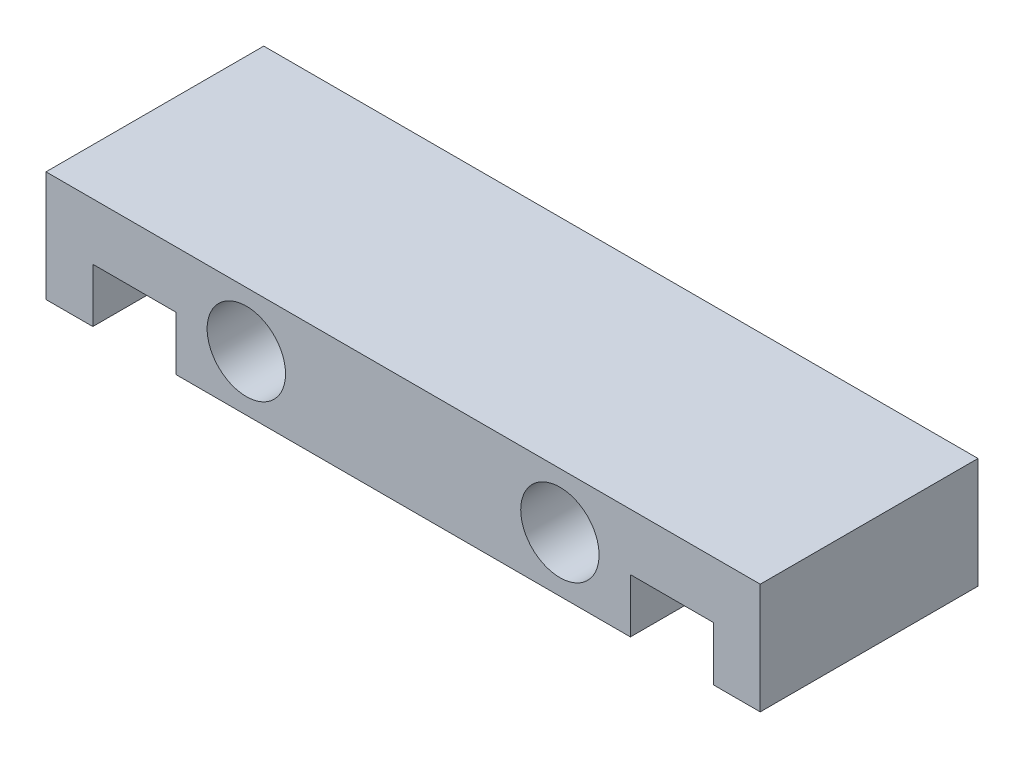
ISO-10303-21;
HEADER;
FILE_DESCRIPTION(('STEP AP214'),'2;1');
FILE_NAME('part.step','',(''),(''),'','','');
FILE_SCHEMA(('AUTOMOTIVE_DESIGN { 1 0 10303 214 1 1 1 1 }'));
ENDSEC;
DATA;
#1=APPLICATION_CONTEXT('core data for automotive mechanical design processes');
#2=APPLICATION_PROTOCOL_DEFINITION('international standard','automotive_design',2000,#1);
#3=PRODUCT_CONTEXT('',#1,'mechanical');
#4=PRODUCT('Part','Part','',(#3));
#5=PRODUCT_RELATED_PRODUCT_CATEGORY('part','',(#4));
#6=PRODUCT_DEFINITION_FORMATION('','',#4);
#7=PRODUCT_DEFINITION_CONTEXT('part definition',#1,'design');
#8=PRODUCT_DEFINITION('design','',#6,#7);
#9=PRODUCT_DEFINITION_SHAPE('','',#8);
#10=(LENGTH_UNIT() NAMED_UNIT(*) SI_UNIT(.MILLI.,.METRE.));
#11=(NAMED_UNIT(*) PLANE_ANGLE_UNIT() SI_UNIT($,.RADIAN.));
#12=(NAMED_UNIT(*) SI_UNIT($,.STERADIAN.) SOLID_ANGLE_UNIT());
#13=UNCERTAINTY_MEASURE_WITH_UNIT(LENGTH_MEASURE(1.E-05),#10,'distance_accuracy_value','');
#14=(GEOMETRIC_REPRESENTATION_CONTEXT(3) GLOBAL_UNCERTAINTY_ASSIGNED_CONTEXT((#13)) GLOBAL_UNIT_ASSIGNED_CONTEXT((#10,
#11,#12)) REPRESENTATION_CONTEXT('',''));
#15=CARTESIAN_POINT('',(0.,0.,0.));
#16=DIRECTION('',(0.,0.,1.));
#17=DIRECTION('',(1.,0.,0.));
#18=AXIS2_PLACEMENT_3D('',#15,#16,#17);
#19=CARTESIAN_POINT('',(0.,12.7,0.));
#20=DIRECTION('',(0.,0.,-1.));
#21=DIRECTION('',(-1.,0.,0.));
#22=AXIS2_PLACEMENT_3D('',#19,#20,#21);
#23=PLANE('',#22);
#24=CARTESIAN_POINT('',(59.,6.35,0.));
#25=DIRECTION('',(0.,0.,-1.));
#26=DIRECTION('',(-1.,0.,0.));
#27=AXIS2_PLACEMENT_3D('',#24,#25,#26);
#28=CIRCLE('',#27,4.5);
#29=CARTESIAN_POINT('',(54.5,6.35,0.));
#30=VERTEX_POINT('',#29);
#31=EDGE_CURVE('E159',#30,#30,#28,.T.);
#32=ORIENTED_EDGE('',*,*,#31,.T.);
#33=EDGE_LOOP('',(#32));
#34=FACE_BOUND('',#33,.T.);
#35=CARTESIAN_POINT('',(23.,6.35,0.));
#36=DIRECTION('',(0.,0.,1.));
#37=DIRECTION('',(1.,0.,0.));
#38=AXIS2_PLACEMENT_3D('',#35,#36,#37);
#39=CIRCLE('',#38,4.5);
#40=CARTESIAN_POINT('',(27.5,6.35,0.));
#41=VERTEX_POINT('',#40);
#42=EDGE_CURVE('E168',#41,#41,#39,.T.);
#43=ORIENTED_EDGE('',*,*,#42,.F.);
#44=EDGE_LOOP('',(#43));
#45=FACE_BOUND('',#44,.T.);
#46=DIRECTION('',(0.,-1.,0.));
#47=VECTOR('',#46,1.);
#48=CARTESIAN_POINT('',(76.625,6.2,0.));
#49=LINE('',#48,#47);
#50=CARTESIAN_POINT('',(76.625,6.2,0.));
#51=VERTEX_POINT('',#50);
#52=CARTESIAN_POINT('',(76.625,0.,0.));
#53=VERTEX_POINT('',#52);
#54=EDGE_CURVE('E147',#51,#53,#49,.T.);
#55=ORIENTED_EDGE('',*,*,#54,.T.);
#56=DIRECTION('',(1.,0.,0.));
#57=VECTOR('',#56,1.);
#58=CARTESIAN_POINT('',(0.,0.,0.));
#59=LINE('',#58,#57);
#60=CARTESIAN_POINT('',(82.,0.,0.));
#61=VERTEX_POINT('',#60);
#62=EDGE_CURVE('E215',#53,#61,#59,.T.);
#63=ORIENTED_EDGE('',*,*,#62,.T.);
#64=DIRECTION('',(0.,-1.,0.));
#65=VECTOR('',#64,1.);
#66=CARTESIAN_POINT('',(82.,12.7,0.));
#67=LINE('',#66,#65);
#68=CARTESIAN_POINT('',(82.,12.7,0.));
#69=VERTEX_POINT('',#68);
#70=EDGE_CURVE('E49',#69,#61,#67,.T.);
#71=ORIENTED_EDGE('',*,*,#70,.F.);
#72=DIRECTION('',(1.,0.,0.));
#73=VECTOR('',#72,1.);
#74=CARTESIAN_POINT('',(0.,12.7,0.));
#75=LINE('',#74,#73);
#76=CARTESIAN_POINT('',(0.,12.7,0.));
#77=VERTEX_POINT('',#76);
#78=EDGE_CURVE('E206',#77,#69,#75,.T.);
#79=ORIENTED_EDGE('',*,*,#78,.F.);
#80=DIRECTION('',(0.,-1.,0.));
#81=VECTOR('',#80,1.);
#82=CARTESIAN_POINT('',(0.,12.7,0.));
#83=LINE('',#82,#81);
#84=CARTESIAN_POINT('',(0.,0.,0.));
#85=VERTEX_POINT('',#84);
#86=EDGE_CURVE('E11',#77,#85,#83,.T.);
#87=ORIENTED_EDGE('',*,*,#86,.T.);
#88=CARTESIAN_POINT('',(5.375,0.,0.));
#89=VERTEX_POINT('',#88);
#90=EDGE_CURVE('E216',#85,#89,#59,.T.);
#91=ORIENTED_EDGE('',*,*,#90,.T.);
#92=DIRECTION('',(0.,-1.,0.));
#93=VECTOR('',#92,1.);
#94=CARTESIAN_POINT('',(5.375,6.2,0.));
#95=LINE('',#94,#93);
#96=CARTESIAN_POINT('',(5.375,6.2,0.));
#97=VERTEX_POINT('',#96);
#98=EDGE_CURVE('E175',#97,#89,#95,.T.);
#99=ORIENTED_EDGE('',*,*,#98,.F.);
#100=DIRECTION('',(-1.,0.,0.));
#101=VECTOR('',#100,1.);
#102=CARTESIAN_POINT('',(5.375,6.2,0.));
#103=LINE('',#102,#101);
#104=CARTESIAN_POINT('',(14.905,6.2,0.));
#105=VERTEX_POINT('',#104);
#106=EDGE_CURVE('E182',#105,#97,#103,.T.);
#107=ORIENTED_EDGE('',*,*,#106,.F.);
#108=DIRECTION('',(0.,1.,0.));
#109=VECTOR('',#108,1.);
#110=CARTESIAN_POINT('',(14.905,6.2,0.));
#111=LINE('',#110,#109);
#112=CARTESIAN_POINT('',(14.905,0.,0.));
#113=VERTEX_POINT('',#112);
#114=EDGE_CURVE('E189',#113,#105,#111,.T.);
#115=ORIENTED_EDGE('',*,*,#114,.F.);
#116=CARTESIAN_POINT('',(67.095,0.,0.));
#117=VERTEX_POINT('',#116);
#118=EDGE_CURVE('E220',#113,#117,#59,.T.);
#119=ORIENTED_EDGE('',*,*,#118,.T.);
#120=DIRECTION('',(0.,1.,0.));
#121=VECTOR('',#120,1.);
#122=CARTESIAN_POINT('',(67.095,6.2,0.));
#123=LINE('',#122,#121);
#124=CARTESIAN_POINT('',(67.095,6.2,0.));
#125=VERTEX_POINT('',#124);
#126=EDGE_CURVE('E56',#117,#125,#123,.T.);
#127=ORIENTED_EDGE('',*,*,#126,.T.);
#128=DIRECTION('',(1.,0.,0.));
#129=VECTOR('',#128,1.);
#130=CARTESIAN_POINT('',(76.625,6.2,0.));
#131=LINE('',#130,#129);
#132=EDGE_CURVE('E156',#125,#51,#131,.T.);
#133=ORIENTED_EDGE('',*,*,#132,.T.);
#134=EDGE_LOOP('',(#55,#63,#71,#79,#87,#91,#99,#107,#115,#119,#127,#133));
#135=FACE_BOUND('',#134,.T.);
#136=ADVANCED_FACE('F41',(#34,#45,#135),#23,.F.);
#137=CARTESIAN_POINT('',(0.,12.7,-25.));
#138=DIRECTION('',(0.,0.,1.));
#139=DIRECTION('',(1.,0.,0.));
#140=AXIS2_PLACEMENT_3D('',#137,#138,#139);
#141=PLANE('',#140);
#142=DIRECTION('',(0.,-1.,0.));
#143=VECTOR('',#142,1.);
#144=CARTESIAN_POINT('',(76.625,6.2,-25.));
#145=LINE('',#144,#143);
#146=CARTESIAN_POINT('',(76.625,6.2,-25.));
#147=VERTEX_POINT('',#146);
#148=CARTESIAN_POINT('',(76.625,0.,-25.));
#149=VERTEX_POINT('',#148);
#150=EDGE_CURVE('E141',#147,#149,#145,.T.);
#151=ORIENTED_EDGE('',*,*,#150,.F.);
#152=DIRECTION('',(1.,0.,0.));
#153=VECTOR('',#152,1.);
#154=CARTESIAN_POINT('',(76.625,6.2,-25.));
#155=LINE('',#154,#153);
#156=CARTESIAN_POINT('',(67.095,6.2,-25.));
#157=VERTEX_POINT('',#156);
#158=EDGE_CURVE('E132',#157,#147,#155,.T.);
#159=ORIENTED_EDGE('',*,*,#158,.F.);
#160=DIRECTION('',(0.,1.,0.));
#161=VECTOR('',#160,1.);
#162=CARTESIAN_POINT('',(67.095,6.2,-25.));
#163=LINE('',#162,#161);
#164=CARTESIAN_POINT('',(67.095,0.,-25.));
#165=VERTEX_POINT('',#164);
#166=EDGE_CURVE('E140',#165,#157,#163,.T.);
#167=ORIENTED_EDGE('',*,*,#166,.F.);
#168=DIRECTION('',(-1.,0.,0.));
#169=VECTOR('',#168,1.);
#170=CARTESIAN_POINT('',(0.,0.,-25.));
#171=LINE('',#170,#169);
#172=CARTESIAN_POINT('',(14.905,0.,-25.));
#173=VERTEX_POINT('',#172);
#174=EDGE_CURVE('E64',#165,#173,#171,.T.);
#175=ORIENTED_EDGE('',*,*,#174,.T.);
#176=DIRECTION('',(0.,1.,0.));
#177=VECTOR('',#176,1.);
#178=CARTESIAN_POINT('',(14.905,6.2,-25.));
#179=LINE('',#178,#177);
#180=CARTESIAN_POINT('',(14.905,6.2,-25.));
#181=VERTEX_POINT('',#180);
#182=EDGE_CURVE('E181',#173,#181,#179,.T.);
#183=ORIENTED_EDGE('',*,*,#182,.T.);
#184=DIRECTION('',(-1.,0.,0.));
#185=VECTOR('',#184,1.);
#186=CARTESIAN_POINT('',(5.375,6.2,-25.));
#187=LINE('',#186,#185);
#188=CARTESIAN_POINT('',(5.375,6.2,-25.));
#189=VERTEX_POINT('',#188);
#190=EDGE_CURVE('E184',#181,#189,#187,.T.);
#191=ORIENTED_EDGE('',*,*,#190,.T.);
#192=DIRECTION('',(0.,-1.,0.));
#193=VECTOR('',#192,1.);
#194=CARTESIAN_POINT('',(5.375,6.2,-25.));
#195=LINE('',#194,#193);
#196=CARTESIAN_POINT('',(5.375,0.,-25.));
#197=VERTEX_POINT('',#196);
#198=EDGE_CURVE('E178',#189,#197,#195,.T.);
#199=ORIENTED_EDGE('',*,*,#198,.T.);
#200=CARTESIAN_POINT('',(0.,0.,-25.));
#201=VERTEX_POINT('',#200);
#202=EDGE_CURVE('E222',#197,#201,#171,.T.);
#203=ORIENTED_EDGE('',*,*,#202,.T.);
#204=DIRECTION('',(0.,-1.,0.));
#205=VECTOR('',#204,1.);
#206=CARTESIAN_POINT('',(0.,12.7,-25.));
#207=LINE('',#206,#205);
#208=CARTESIAN_POINT('',(0.,12.7,-25.));
#209=VERTEX_POINT('',#208);
#210=EDGE_CURVE('E212',#209,#201,#207,.T.);
#211=ORIENTED_EDGE('',*,*,#210,.F.);
#212=DIRECTION('',(-1.,0.,0.));
#213=VECTOR('',#212,1.);
#214=CARTESIAN_POINT('',(0.,12.7,-25.));
#215=LINE('',#214,#213);
#216=CARTESIAN_POINT('',(82.,12.7,-25.));
#217=VERTEX_POINT('',#216);
#218=EDGE_CURVE('E210',#217,#209,#215,.T.);
#219=ORIENTED_EDGE('',*,*,#218,.F.);
#220=DIRECTION('',(0.,-1.,0.));
#221=VECTOR('',#220,1.);
#222=CARTESIAN_POINT('',(82.,12.7,-25.));
#223=LINE('',#222,#221);
#224=CARTESIAN_POINT('',(82.,0.,-25.));
#225=VERTEX_POINT('',#224);
#226=EDGE_CURVE('E226',#217,#225,#223,.T.);
#227=ORIENTED_EDGE('',*,*,#226,.T.);
#228=EDGE_CURVE('E154',#225,#149,#171,.T.);
#229=ORIENTED_EDGE('',*,*,#228,.T.);
#230=EDGE_LOOP('',(#151,#159,#167,#175,#183,#191,#199,#203,#211,#219,#227,#229));
#231=FACE_BOUND('',#230,.T.);
#232=ADVANCED_FACE('F151',(#231),#141,.F.);
#233=CARTESIAN_POINT('',(0.,0.,0.));
#234=DIRECTION('',(0.,-1.,0.));
#235=DIRECTION('',(0.,0.,-1.));
#236=AXIS2_PLACEMENT_3D('',#233,#234,#235);
#237=PLANE('',#236);
#238=ORIENTED_EDGE('',*,*,#62,.F.);
#239=DIRECTION('',(0.,0.,1.));
#240=VECTOR('',#239,1.);
#241=CARTESIAN_POINT('',(76.625,0.,-25.));
#242=LINE('',#241,#240);
#243=EDGE_CURVE('E166',#149,#53,#242,.T.);
#244=ORIENTED_EDGE('',*,*,#243,.F.);
#245=ORIENTED_EDGE('',*,*,#228,.F.);
#246=DIRECTION('',(0.,0.,-1.));
#247=VECTOR('',#246,1.);
#248=CARTESIAN_POINT('',(82.,0.,0.));
#249=LINE('',#248,#247);
#250=EDGE_CURVE('E219',#61,#225,#249,.T.);
#251=ORIENTED_EDGE('',*,*,#250,.F.);
#252=EDGE_LOOP('',(#238,#244,#245,#251));
#253=FACE_BOUND('',#252,.T.);
#254=ADVANCED_FACE('F237',(#253),#237,.T.);
#255=ORIENTED_EDGE('',*,*,#174,.F.);
#256=DIRECTION('',(0.,0.,1.));
#257=VECTOR('',#256,1.);
#258=CARTESIAN_POINT('',(67.095,0.,-25.));
#259=LINE('',#258,#257);
#260=EDGE_CURVE('E169',#165,#117,#259,.T.);
#261=ORIENTED_EDGE('',*,*,#260,.T.);
#262=ORIENTED_EDGE('',*,*,#118,.F.);
#263=DIRECTION('',(0.,0.,1.));
#264=VECTOR('',#263,1.);
#265=CARTESIAN_POINT('',(14.905,0.,-25.));
#266=LINE('',#265,#264);
#267=EDGE_CURVE('E199',#173,#113,#266,.T.);
#268=ORIENTED_EDGE('',*,*,#267,.F.);
#269=EDGE_LOOP('',(#255,#261,#262,#268));
#270=FACE_BOUND('',#269,.T.);
#271=ADVANCED_FACE('F244',(#270),#237,.T.);
#272=DIRECTION('',(0.,0.,1.));
#273=VECTOR('',#272,1.);
#274=CARTESIAN_POINT('',(5.375,0.,-25.));
#275=LINE('',#274,#273);
#276=EDGE_CURVE('E187',#197,#89,#275,.T.);
#277=ORIENTED_EDGE('',*,*,#276,.T.);
#278=ORIENTED_EDGE('',*,*,#90,.F.);
#279=DIRECTION('',(0.,0.,1.));
#280=VECTOR('',#279,1.);
#281=CARTESIAN_POINT('',(0.,0.,0.));
#282=LINE('',#281,#280);
#283=EDGE_CURVE('E196',#201,#85,#282,.T.);
#284=ORIENTED_EDGE('',*,*,#283,.F.);
#285=ORIENTED_EDGE('',*,*,#202,.F.);
#286=EDGE_LOOP('',(#277,#278,#284,#285));
#287=FACE_BOUND('',#286,.T.);
#288=ADVANCED_FACE('F271',(#287),#237,.T.);
#289=CARTESIAN_POINT('',(0.,12.7,0.));
#290=DIRECTION('',(1.,0.,0.));
#291=DIRECTION('',(0.,0.,-1.));
#292=AXIS2_PLACEMENT_3D('',#289,#290,#291);
#293=PLANE('',#292);
#294=ORIENTED_EDGE('',*,*,#283,.T.);
#295=ORIENTED_EDGE('',*,*,#86,.F.);
#296=DIRECTION('',(0.,0.,1.));
#297=VECTOR('',#296,1.);
#298=CARTESIAN_POINT('',(0.,12.7,0.));
#299=LINE('',#298,#297);
#300=EDGE_CURVE('E203',#209,#77,#299,.T.);
#301=ORIENTED_EDGE('',*,*,#300,.F.);
#302=ORIENTED_EDGE('',*,*,#210,.T.);
#303=EDGE_LOOP('',(#294,#295,#301,#302));
#304=FACE_BOUND('',#303,.T.);
#305=ADVANCED_FACE('F43',(#304),#293,.F.);
#306=CARTESIAN_POINT('',(82.,12.7,0.));
#307=DIRECTION('',(-1.,0.,0.));
#308=DIRECTION('',(0.,0.,1.));
#309=AXIS2_PLACEMENT_3D('',#306,#307,#308);
#310=PLANE('',#309);
#311=ORIENTED_EDGE('',*,*,#250,.T.);
#312=ORIENTED_EDGE('',*,*,#226,.F.);
#313=DIRECTION('',(0.,0.,-1.));
#314=VECTOR('',#313,1.);
#315=CARTESIAN_POINT('',(82.,12.7,0.));
#316=LINE('',#315,#314);
#317=EDGE_CURVE('E208',#69,#217,#316,.T.);
#318=ORIENTED_EDGE('',*,*,#317,.F.);
#319=ORIENTED_EDGE('',*,*,#70,.T.);
#320=EDGE_LOOP('',(#311,#312,#318,#319));
#321=FACE_BOUND('',#320,.T.);
#322=ADVANCED_FACE('F232',(#321),#310,.F.);
#323=CARTESIAN_POINT('',(0.,12.7,0.));
#324=DIRECTION('',(0.,-1.,0.));
#325=DIRECTION('',(0.,0.,-1.));
#326=AXIS2_PLACEMENT_3D('',#323,#324,#325);
#327=PLANE('',#326);
#328=ORIENTED_EDGE('',*,*,#300,.T.);
#329=ORIENTED_EDGE('',*,*,#78,.T.);
#330=ORIENTED_EDGE('',*,*,#317,.T.);
#331=ORIENTED_EDGE('',*,*,#218,.T.);
#332=EDGE_LOOP('',(#328,#329,#330,#331));
#333=FACE_BOUND('',#332,.T.);
#334=ADVANCED_FACE('F267',(#333),#327,.F.);
#335=CARTESIAN_POINT('',(5.375,6.2,-25.));
#336=DIRECTION('',(-1.,0.,0.));
#337=DIRECTION('',(0.,-1.,0.));
#338=AXIS2_PLACEMENT_3D('',#335,#336,#337);
#339=PLANE('',#338);
#340=ORIENTED_EDGE('',*,*,#98,.T.);
#341=ORIENTED_EDGE('',*,*,#276,.F.);
#342=ORIENTED_EDGE('',*,*,#198,.F.);
#343=DIRECTION('',(0.,0.,1.));
#344=VECTOR('',#343,1.);
#345=CARTESIAN_POINT('',(5.375,6.2,-25.));
#346=LINE('',#345,#344);
#347=EDGE_CURVE('E194',#189,#97,#346,.T.);
#348=ORIENTED_EDGE('',*,*,#347,.T.);
#349=EDGE_LOOP('',(#340,#341,#342,#348));
#350=FACE_BOUND('',#349,.T.);
#351=ADVANCED_FACE('F274',(#350),#339,.F.);
#352=CARTESIAN_POINT('',(5.375,6.2,-25.));
#353=DIRECTION('',(0.,1.,0.));
#354=DIRECTION('',(0.,0.,1.));
#355=AXIS2_PLACEMENT_3D('',#352,#353,#354);
#356=PLANE('',#355);
#357=ORIENTED_EDGE('',*,*,#106,.T.);
#358=ORIENTED_EDGE('',*,*,#347,.F.);
#359=ORIENTED_EDGE('',*,*,#190,.F.);
#360=DIRECTION('',(0.,0.,1.));
#361=VECTOR('',#360,1.);
#362=CARTESIAN_POINT('',(14.905,6.2,-25.));
#363=LINE('',#362,#361);
#364=EDGE_CURVE('E197',#181,#105,#363,.T.);
#365=ORIENTED_EDGE('',*,*,#364,.T.);
#366=EDGE_LOOP('',(#357,#358,#359,#365));
#367=FACE_BOUND('',#366,.T.);
#368=ADVANCED_FACE('F278',(#367),#356,.F.);
#369=CARTESIAN_POINT('',(14.905,6.2,-25.));
#370=DIRECTION('',(1.,0.,0.));
#371=DIRECTION('',(0.,1.,0.));
#372=AXIS2_PLACEMENT_3D('',#369,#370,#371);
#373=PLANE('',#372);
#374=ORIENTED_EDGE('',*,*,#114,.T.);
#375=ORIENTED_EDGE('',*,*,#364,.F.);
#376=ORIENTED_EDGE('',*,*,#182,.F.);
#377=ORIENTED_EDGE('',*,*,#267,.T.);
#378=EDGE_LOOP('',(#374,#375,#376,#377));
#379=FACE_BOUND('',#378,.T.);
#380=ADVANCED_FACE('F280',(#379),#373,.F.);
#381=CARTESIAN_POINT('',(23.,6.35,-13.));
#382=DIRECTION('',(0.,0.,1.));
#383=DIRECTION('',(1.,0.,0.));
#384=AXIS2_PLACEMENT_3D('',#381,#382,#383);
#385=CYLINDRICAL_SURFACE('',#384,4.5);
#386=CARTESIAN_POINT('',(23.,6.35,-13.));
#387=DIRECTION('',(0.,0.,1.));
#388=DIRECTION('',(1.,0.,0.));
#389=AXIS2_PLACEMENT_3D('',#386,#387,#388);
#390=CIRCLE('',#389,4.5);
#391=CARTESIAN_POINT('',(27.5,6.35,-13.));
#392=VERTEX_POINT('',#391);
#393=EDGE_CURVE('E172',#392,#392,#390,.T.);
#394=ORIENTED_EDGE('',*,*,#393,.F.);
#395=EDGE_LOOP('',(#394));
#396=FACE_BOUND('',#395,.T.);
#397=ORIENTED_EDGE('',*,*,#42,.T.);
#398=EDGE_LOOP('',(#397));
#399=FACE_BOUND('',#398,.T.);
#400=ADVANCED_FACE('F283',(#396,#399),#385,.F.);
#401=CARTESIAN_POINT('',(23.,6.35,-13.));
#402=DIRECTION('',(0.,0.,1.));
#403=DIRECTION('',(1.,0.,0.));
#404=AXIS2_PLACEMENT_3D('',#401,#402,#403);
#405=PLANE('',#404);
#406=ORIENTED_EDGE('',*,*,#393,.T.);
#407=EDGE_LOOP('',(#406));
#408=FACE_BOUND('',#407,.T.);
#409=ADVANCED_FACE('F254',(#408),#405,.T.);
#410=CARTESIAN_POINT('',(76.625,6.2,-25.));
#411=DIRECTION('',(-1.,0.,0.));
#412=DIRECTION('',(0.,-1.,0.));
#413=AXIS2_PLACEMENT_3D('',#410,#411,#412);
#414=PLANE('',#413);
#415=ORIENTED_EDGE('',*,*,#54,.F.);
#416=DIRECTION('',(0.,0.,1.));
#417=VECTOR('',#416,1.);
#418=CARTESIAN_POINT('',(76.625,6.2,-25.));
#419=LINE('',#418,#417);
#420=EDGE_CURVE('E136',#147,#51,#419,.T.);
#421=ORIENTED_EDGE('',*,*,#420,.F.);
#422=ORIENTED_EDGE('',*,*,#150,.T.);
#423=ORIENTED_EDGE('',*,*,#243,.T.);
#424=EDGE_LOOP('',(#415,#421,#422,#423));
#425=FACE_BOUND('',#424,.T.);
#426=ADVANCED_FACE('F144',(#425),#414,.T.);
#427=CARTESIAN_POINT('',(67.095,6.2,-25.));
#428=DIRECTION('',(1.,0.,0.));
#429=DIRECTION('',(0.,1.,0.));
#430=AXIS2_PLACEMENT_3D('',#427,#428,#429);
#431=PLANE('',#430);
#432=ORIENTED_EDGE('',*,*,#126,.F.);
#433=ORIENTED_EDGE('',*,*,#260,.F.);
#434=ORIENTED_EDGE('',*,*,#166,.T.);
#435=DIRECTION('',(0.,0.,1.));
#436=VECTOR('',#435,1.);
#437=CARTESIAN_POINT('',(67.095,6.2,-25.));
#438=LINE('',#437,#436);
#439=EDGE_CURVE('E138',#157,#125,#438,.T.);
#440=ORIENTED_EDGE('',*,*,#439,.T.);
#441=EDGE_LOOP('',(#432,#433,#434,#440));
#442=FACE_BOUND('',#441,.T.);
#443=ADVANCED_FACE('F245',(#442),#431,.T.);
#444=CARTESIAN_POINT('',(76.625,6.2,-25.));
#445=DIRECTION('',(0.,-1.,0.));
#446=DIRECTION('',(0.,0.,-1.));
#447=AXIS2_PLACEMENT_3D('',#444,#445,#446);
#448=PLANE('',#447);
#449=ORIENTED_EDGE('',*,*,#132,.F.);
#450=ORIENTED_EDGE('',*,*,#439,.F.);
#451=ORIENTED_EDGE('',*,*,#158,.T.);
#452=ORIENTED_EDGE('',*,*,#420,.T.);
#453=EDGE_LOOP('',(#449,#450,#451,#452));
#454=FACE_BOUND('',#453,.T.);
#455=ADVANCED_FACE('F135',(#454),#448,.T.);
#456=CARTESIAN_POINT('',(59.,6.35,-13.));
#457=DIRECTION('',(0.,0.,1.));
#458=DIRECTION('',(1.,0.,0.));
#459=AXIS2_PLACEMENT_3D('',#456,#457,#458);
#460=CYLINDRICAL_SURFACE('',#459,4.5);
#461=CARTESIAN_POINT('',(59.,6.35,-13.));
#462=DIRECTION('',(0.,0.,-1.));
#463=DIRECTION('',(-1.,0.,0.));
#464=AXIS2_PLACEMENT_3D('',#461,#462,#463);
#465=CIRCLE('',#464,4.5);
#466=CARTESIAN_POINT('',(54.5,6.35,-13.));
#467=VERTEX_POINT('',#466);
#468=EDGE_CURVE('E164',#467,#467,#465,.T.);
#469=ORIENTED_EDGE('',*,*,#468,.T.);
#470=EDGE_LOOP('',(#469));
#471=FACE_BOUND('',#470,.T.);
#472=ORIENTED_EDGE('',*,*,#31,.F.);
#473=EDGE_LOOP('',(#472));
#474=FACE_BOUND('',#473,.T.);
#475=ADVANCED_FACE('F252',(#471,#474),#460,.F.);
#476=CARTESIAN_POINT('',(59.,6.35,-13.));
#477=DIRECTION('',(0.,0.,1.));
#478=DIRECTION('',(-1.,0.,0.));
#479=AXIS2_PLACEMENT_3D('',#476,#477,#478);
#480=PLANE('',#479);
#481=ORIENTED_EDGE('',*,*,#468,.F.);
#482=EDGE_LOOP('',(#481));
#483=FACE_BOUND('',#482,.T.);
#484=ADVANCED_FACE('F332',(#483),#480,.T.);
#485=CLOSED_SHELL('',(#136,#232,#254,#271,#288,#305,#322,#334,#351,#368,#380,#400,#409,#426,
#443,#455,#475,#484));
#486=MANIFOLD_SOLID_BREP('B2',#485);
#487=ADVANCED_BREP_SHAPE_REPRESENTATION('',(#18,#486),#14);
#488=SHAPE_DEFINITION_REPRESENTATION(#9,#487);
ENDSEC;
END-ISO-10303-21;
